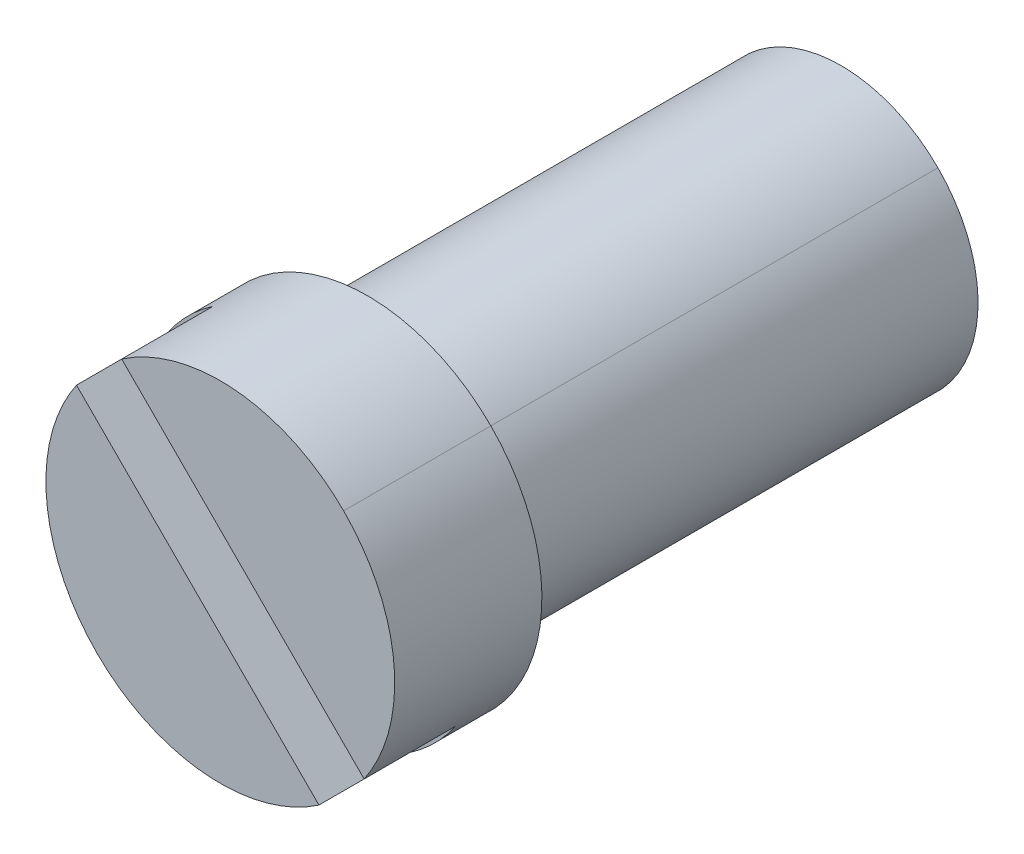
ISO-10303-21;
HEADER;
FILE_DESCRIPTION(('STEP AP214'),'2;1');
FILE_NAME('part.step','',(''),(''),'','','');
FILE_SCHEMA(('AUTOMOTIVE_DESIGN { 1 0 10303 214 1 1 1 1 }'));
ENDSEC;
DATA;
#1=APPLICATION_CONTEXT('core data for automotive mechanical design processes');
#2=APPLICATION_PROTOCOL_DEFINITION('international standard','automotive_design',2000,#1);
#3=PRODUCT_CONTEXT('',#1,'mechanical');
#4=PRODUCT('Part','Part','',(#3));
#5=PRODUCT_RELATED_PRODUCT_CATEGORY('part','',(#4));
#6=PRODUCT_DEFINITION_FORMATION('','',#4);
#7=PRODUCT_DEFINITION_CONTEXT('part definition',#1,'design');
#8=PRODUCT_DEFINITION('design','',#6,#7);
#9=PRODUCT_DEFINITION_SHAPE('','',#8);
#10=(LENGTH_UNIT() NAMED_UNIT(*) SI_UNIT(.MILLI.,.METRE.));
#11=(NAMED_UNIT(*) PLANE_ANGLE_UNIT() SI_UNIT($,.RADIAN.));
#12=(NAMED_UNIT(*) SI_UNIT($,.STERADIAN.) SOLID_ANGLE_UNIT());
#13=UNCERTAINTY_MEASURE_WITH_UNIT(LENGTH_MEASURE(1.E-05),#10,'distance_accuracy_value','');
#14=(GEOMETRIC_REPRESENTATION_CONTEXT(3) GLOBAL_UNCERTAINTY_ASSIGNED_CONTEXT((#13)) GLOBAL_UNIT_ASSIGNED_CONTEXT((#10,
#11,#12)) REPRESENTATION_CONTEXT('',''));
#15=CARTESIAN_POINT('',(0.,0.,0.));
#16=DIRECTION('',(0.,0.,1.));
#17=DIRECTION('',(1.,0.,0.));
#18=AXIS2_PLACEMENT_3D('',#15,#16,#17);
#19=CARTESIAN_POINT('',(17.780343805971,5.27034380597093,8.76943375672969));
#20=DIRECTION('',(0.,0.,1.));
#21=DIRECTION('',(0.707106781186547,0.707106781186548,0.));
#22=AXIS2_PLACEMENT_3D('',#19,#20,#21);
#23=CYLINDRICAL_SURFACE('',#22,1.5);
#24=DIRECTION('',(0.,0.,-1.));
#25=VECTOR('',#24,1.);
#26=CARTESIAN_POINT('',(18.8410039777508,6.33100397775075,8.76943375672969));
#27=LINE('',#26,#25);
#28=CARTESIAN_POINT('',(18.8410039777508,6.33100397775075,12.0176388374866));
#29=VERTEX_POINT('',#28);
#30=CARTESIAN_POINT('',(18.8410039777508,6.33100397775075,6.83));
#31=VERTEX_POINT('',#30);
#32=EDGE_CURVE('E28',#29,#31,#27,.T.);
#33=ORIENTED_EDGE('',*,*,#32,.F.);
#34=CARTESIAN_POINT('',(17.780343805971,5.27034380597093,12.0176388374866));
#35=DIRECTION('',(0.,0.,-1.));
#36=DIRECTION('',(0.707106781186547,0.707106781186548,0.));
#37=AXIS2_PLACEMENT_3D('',#34,#35,#36);
#38=CIRCLE('',#37,1.5);
#39=CARTESIAN_POINT('',(16.7196836341912,4.20968363419111,12.0176388374866));
#40=VERTEX_POINT('',#39);
#41=EDGE_CURVE('E153',#29,#40,#38,.T.);
#42=ORIENTED_EDGE('',*,*,#41,.T.);
#43=DIRECTION('',(0.,0.,-1.));
#44=VECTOR('',#43,1.);
#45=CARTESIAN_POINT('',(16.7196836341912,4.20968363419111,8.76943375672969));
#46=LINE('',#45,#44);
#47=CARTESIAN_POINT('',(16.7196836341912,4.20968363419111,6.83));
#48=VERTEX_POINT('',#47);
#49=EDGE_CURVE('E118',#40,#48,#46,.T.);
#50=ORIENTED_EDGE('',*,*,#49,.T.);
#51=CARTESIAN_POINT('',(17.780343805971,5.27034380597093,6.83));
#52=DIRECTION('',(0.,0.,-1.));
#53=DIRECTION('',(0.707106781186547,0.707106781186548,0.));
#54=AXIS2_PLACEMENT_3D('',#51,#52,#53);
#55=CIRCLE('',#54,1.5);
#56=EDGE_CURVE('E119',#31,#48,#55,.T.);
#57=ORIENTED_EDGE('',*,*,#56,.F.);
#58=EDGE_LOOP('',(#33,#42,#50,#57));
#59=FACE_BOUND('',#58,.T.);
#60=ADVANCED_FACE('F17',(#59),#23,.T.);
#61=CARTESIAN_POINT('',(17.780343805971,5.27034380597093,12.8238194187433));
#62=DIRECTION('',(0.,0.,-1.));
#63=DIRECTION('',(0.707106781186545,0.70710678118655,0.));
#64=AXIS2_PLACEMENT_3D('',#61,#62,#63);
#65=CYLINDRICAL_SURFACE('',#64,1.91034380597093);
#66=DIRECTION('',(0.,0.,1.));
#67=VECTOR('',#66,1.);
#68=CARTESIAN_POINT('',(16.4295267463712,3.91952674637119,12.8238194187433));
#69=LINE('',#68,#67);
#70=CARTESIAN_POINT('',(16.4295267463712,3.91952674637119,12.0176388374866));
#71=VERTEX_POINT('',#70);
#72=CARTESIAN_POINT('',(16.4295267463712,3.91952674637119,13.63));
#73=VERTEX_POINT('',#72);
#74=EDGE_CURVE('E152',#71,#73,#69,.T.);
#75=ORIENTED_EDGE('',*,*,#74,.T.);
#76=CARTESIAN_POINT('',(17.780343805971,5.27034380597093,13.63));
#77=DIRECTION('',(0.,0.,1.));
#78=DIRECTION('',(0.707106781186545,0.70710678118655,0.));
#79=AXIS2_PLACEMENT_3D('',#76,#77,#78);
#80=CIRCLE('',#79,1.91034380597093);
#81=CARTESIAN_POINT('',(16.2049043519045,6.35080851320685,13.63));
#82=VERTEX_POINT('',#81);
#83=EDGE_CURVE('E68',#82,#73,#80,.T.);
#84=ORIENTED_EDGE('',*,*,#83,.F.);
#85=DIRECTION('',(0.,0.,1.));
#86=VECTOR('',#85,1.);
#87=CARTESIAN_POINT('',(16.2049043519045,6.35080851320685,12.8238194187433));
#88=LINE('',#87,#86);
#89=CARTESIAN_POINT('',(16.2049043519045,6.35080851320685,12.63));
#90=VERTEX_POINT('',#89);
#91=EDGE_CURVE('E121',#90,#82,#88,.T.);
#92=ORIENTED_EDGE('',*,*,#91,.F.);
#93=CARTESIAN_POINT('',(17.780343805971,5.27034380597093,12.63));
#94=DIRECTION('',(0.,0.,1.));
#95=DIRECTION('',(0.707106781186545,0.70710678118655,0.));
#96=AXIS2_PLACEMENT_3D('',#93,#94,#95);
#97=CIRCLE('',#96,1.91034380597093);
#98=CARTESIAN_POINT('',(16.6998790987351,6.84578326003743,12.63));
#99=VERTEX_POINT('',#98);
#100=EDGE_CURVE('E21',#99,#90,#97,.T.);
#101=ORIENTED_EDGE('',*,*,#100,.F.);
#102=DIRECTION('',(0.,0.,1.));
#103=VECTOR('',#102,1.);
#104=CARTESIAN_POINT('',(16.6998790987351,6.84578326003743,12.8238194187433));
#105=LINE('',#104,#103);
#106=CARTESIAN_POINT('',(16.6998790987351,6.84578326003743,13.63));
#107=VERTEX_POINT('',#106);
#108=EDGE_CURVE('E173',#99,#107,#105,.T.);
#109=ORIENTED_EDGE('',*,*,#108,.T.);
#110=CARTESIAN_POINT('',(17.780343805971,5.27034380597093,13.63));
#111=DIRECTION('',(0.,0.,1.));
#112=DIRECTION('',(0.707106781186545,0.70710678118655,0.));
#113=AXIS2_PLACEMENT_3D('',#110,#111,#112);
#114=CIRCLE('',#113,1.91034380597093);
#115=CARTESIAN_POINT('',(19.1311608655707,6.62116086557068,13.63));
#116=VERTEX_POINT('',#115);
#117=EDGE_CURVE('E11',#116,#107,#114,.T.);
#118=ORIENTED_EDGE('',*,*,#117,.F.);
#119=DIRECTION('',(0.,0.,1.));
#120=VECTOR('',#119,1.);
#121=CARTESIAN_POINT('',(19.1311608655707,6.62116086557068,12.8238194187433));
#122=LINE('',#121,#120);
#123=CARTESIAN_POINT('',(19.1311608655707,6.62116086557068,12.0176388374866));
#124=VERTEX_POINT('',#123);
#125=EDGE_CURVE('E148',#124,#116,#122,.T.);
#126=ORIENTED_EDGE('',*,*,#125,.F.);
#127=CARTESIAN_POINT('',(17.780343805971,5.27034380597093,12.0176388374866));
#128=DIRECTION('',(0.,0.,-1.));
#129=DIRECTION('',(0.70710678118655,-0.707106781186545,0.));
#130=AXIS2_PLACEMENT_3D('',#127,#128,#129);
#131=CIRCLE('',#130,1.91034380597093);
#132=EDGE_CURVE('E165',#71,#124,#131,.T.);
#133=ORIENTED_EDGE('',*,*,#132,.F.);
#134=EDGE_LOOP('',(#75,#84,#92,#101,#109,#118,#126,#133));
#135=FACE_BOUND('',#134,.T.);
#136=ADVANCED_FACE('F122',(#135),#65,.T.);
#137=CARTESIAN_POINT('',(18.8822202938885,4.16846731805341,13.63));
#138=DIRECTION('',(0.,0.,-1.));
#139=DIRECTION('',(0.,-1.,0.));
#140=AXIS2_PLACEMENT_3D('',#137,#138,#139);
#141=PLANE('',#140);
#142=DIRECTION('',(-0.707106781186548,0.707106781186547,0.));
#143=VECTOR('',#142,1.);
#144=CARTESIAN_POINT('',(18.0278311793863,5.51783117938623,13.63));
#145=LINE('',#144,#143);
#146=CARTESIAN_POINT('',(19.3557832600374,4.1898790987351,13.63));
#147=VERTEX_POINT('',#146);
#148=EDGE_CURVE('E140',#147,#107,#145,.T.);
#149=ORIENTED_EDGE('',*,*,#148,.F.);
#150=CARTESIAN_POINT('',(17.780343805971,5.27034380597093,13.63));
#151=DIRECTION('',(0.,0.,1.));
#152=DIRECTION('',(0.707106781186545,0.70710678118655,0.));
#153=AXIS2_PLACEMENT_3D('',#150,#151,#152);
#154=CIRCLE('',#153,1.91034380597093);
#155=EDGE_CURVE('E170',#147,#116,#154,.T.);
#156=ORIENTED_EDGE('',*,*,#155,.T.);
#157=ORIENTED_EDGE('',*,*,#117,.T.);
#158=EDGE_LOOP('',(#149,#156,#157));
#159=FACE_BOUND('',#158,.T.);
#160=ADVANCED_FACE('F187',(#159),#141,.F.);
#161=CARTESIAN_POINT('',(17.780343805971,5.27034380597093,8.76943375672969));
#162=DIRECTION('',(0.,0.,1.));
#163=DIRECTION('',(0.707106781186547,0.707106781186548,0.));
#164=AXIS2_PLACEMENT_3D('',#161,#162,#163);
#165=CYLINDRICAL_SURFACE('',#164,1.5);
#166=CARTESIAN_POINT('',(17.780343805971,5.27034380597093,6.83));
#167=DIRECTION('',(0.,0.,-1.));
#168=DIRECTION('',(0.707106781186547,0.707106781186548,0.));
#169=AXIS2_PLACEMENT_3D('',#166,#167,#168);
#170=CIRCLE('',#169,1.5);
#171=EDGE_CURVE('E162',#48,#31,#170,.T.);
#172=ORIENTED_EDGE('',*,*,#171,.F.);
#173=ORIENTED_EDGE('',*,*,#49,.F.);
#174=CARTESIAN_POINT('',(17.780343805971,5.27034380597093,12.0176388374866));
#175=DIRECTION('',(0.,0.,-1.));
#176=DIRECTION('',(0.707106781186547,0.707106781186548,0.));
#177=AXIS2_PLACEMENT_3D('',#174,#175,#176);
#178=CIRCLE('',#177,1.5);
#179=EDGE_CURVE('E157',#40,#29,#178,.T.);
#180=ORIENTED_EDGE('',*,*,#179,.T.);
#181=ORIENTED_EDGE('',*,*,#32,.T.);
#182=EDGE_LOOP('',(#172,#173,#180,#181));
#183=FACE_BOUND('',#182,.T.);
#184=ADVANCED_FACE('F234',(#183),#165,.T.);
#185=CARTESIAN_POINT('',(16.4156260212247,7.13003633754783,12.63));
#186=DIRECTION('',(0.,0.,-1.));
#187=DIRECTION('',(0.,-1.,0.));
#188=AXIS2_PLACEMENT_3D('',#185,#186,#187);
#189=PLANE('',#188);
#190=DIRECTION('',(-0.707106781186548,0.707106781186547,0.));
#191=VECTOR('',#190,1.);
#192=CARTESIAN_POINT('',(18.0278311793863,5.51783117938623,12.63));
#193=LINE('',#192,#191);
#194=CARTESIAN_POINT('',(19.3557832600374,4.1898790987351,12.63));
#195=VERTEX_POINT('',#194);
#196=EDGE_CURVE('E115',#195,#99,#193,.T.);
#197=ORIENTED_EDGE('',*,*,#196,.T.);
#198=ORIENTED_EDGE('',*,*,#100,.T.);
#199=DIRECTION('',(0.707106781186548,-0.707106781186547,0.));
#200=VECTOR('',#199,1.);
#201=CARTESIAN_POINT('',(17.5328564325557,5.02285643255565,12.63));
#202=LINE('',#201,#200);
#203=CARTESIAN_POINT('',(18.8608085132068,3.69490435190452,12.63));
#204=VERTEX_POINT('',#203);
#205=EDGE_CURVE('E113',#90,#204,#202,.T.);
#206=ORIENTED_EDGE('',*,*,#205,.T.);
#207=CARTESIAN_POINT('',(17.780343805971,5.27034380597093,12.63));
#208=DIRECTION('',(0.,0.,1.));
#209=DIRECTION('',(0.707106781186545,0.70710678118655,0.));
#210=AXIS2_PLACEMENT_3D('',#207,#208,#209);
#211=CIRCLE('',#210,1.91034380597093);
#212=EDGE_CURVE('E101',#204,#195,#211,.T.);
#213=ORIENTED_EDGE('',*,*,#212,.T.);
#214=EDGE_LOOP('',(#197,#198,#206,#213));
#215=FACE_BOUND('',#214,.T.);
#216=ADVANCED_FACE('F111',(#215),#189,.F.);
#217=CARTESIAN_POINT('',(17.3825962415535,4.8725962415535,6.83));
#218=DIRECTION('',(0.,0.,1.));
#219=DIRECTION('',(0.,-1.,0.));
#220=AXIS2_PLACEMENT_3D('',#217,#218,#219);
#221=PLANE('',#220);
#222=ORIENTED_EDGE('',*,*,#171,.T.);
#223=ORIENTED_EDGE('',*,*,#56,.T.);
#224=EDGE_LOOP('',(#222,#223));
#225=FACE_BOUND('',#224,.T.);
#226=ADVANCED_FACE('F210',(#225),#221,.F.);
#227=CARTESIAN_POINT('',(18.8822202938885,4.16846731805341,13.63));
#228=DIRECTION('',(0.,0.,-1.));
#229=DIRECTION('',(0.,-1.,0.));
#230=AXIS2_PLACEMENT_3D('',#227,#228,#229);
#231=PLANE('',#230);
#232=CARTESIAN_POINT('',(17.780343805971,5.27034380597093,13.63));
#233=DIRECTION('',(0.,0.,1.));
#234=DIRECTION('',(0.707106781186545,0.70710678118655,0.));
#235=AXIS2_PLACEMENT_3D('',#232,#233,#234);
#236=CIRCLE('',#235,1.91034380597093);
#237=CARTESIAN_POINT('',(18.8608085132068,3.69490435190452,13.63));
#238=VERTEX_POINT('',#237);
#239=EDGE_CURVE('E149',#73,#238,#236,.T.);
#240=ORIENTED_EDGE('',*,*,#239,.T.);
#241=DIRECTION('',(0.707106781186548,-0.707106781186547,0.));
#242=VECTOR('',#241,1.);
#243=CARTESIAN_POINT('',(17.5328564325557,5.02285643255565,13.63));
#244=LINE('',#243,#242);
#245=EDGE_CURVE('E126',#82,#238,#244,.T.);
#246=ORIENTED_EDGE('',*,*,#245,.F.);
#247=ORIENTED_EDGE('',*,*,#83,.T.);
#248=EDGE_LOOP('',(#240,#246,#247));
#249=FACE_BOUND('',#248,.T.);
#250=ADVANCED_FACE('F208',(#249),#231,.F.);
#251=CARTESIAN_POINT('',(18.9455851493971,4.10510246254486,12.0176388374866));
#252=DIRECTION('',(0.,0.,1.));
#253=DIRECTION('',(0.,-1.,0.));
#254=AXIS2_PLACEMENT_3D('',#251,#252,#253);
#255=PLANE('',#254);
#256=ORIENTED_EDGE('',*,*,#179,.F.);
#257=ORIENTED_EDGE('',*,*,#41,.F.);
#258=EDGE_LOOP('',(#256,#257));
#259=FACE_BOUND('',#258,.T.);
#260=CARTESIAN_POINT('',(17.780343805971,5.27034380597093,12.0176388374866));
#261=DIRECTION('',(0.,0.,-1.));
#262=DIRECTION('',(0.70710678118655,-0.707106781186545,0.));
#263=AXIS2_PLACEMENT_3D('',#260,#261,#262);
#264=CIRCLE('',#263,1.91034380597093);
#265=EDGE_CURVE('E144',#124,#71,#264,.T.);
#266=ORIENTED_EDGE('',*,*,#265,.T.);
#267=ORIENTED_EDGE('',*,*,#132,.T.);
#268=EDGE_LOOP('',(#266,#267));
#269=FACE_BOUND('',#268,.T.);
#270=ADVANCED_FACE('F19',(#259,#269),#255,.F.);
#271=CARTESIAN_POINT('',(17.780343805971,5.27034380597093,12.8238194187433));
#272=DIRECTION('',(0.,0.,-1.));
#273=DIRECTION('',(0.707106781186545,0.70710678118655,0.));
#274=AXIS2_PLACEMENT_3D('',#271,#272,#273);
#275=CYLINDRICAL_SURFACE('',#274,1.91034380597093);
#276=ORIENTED_EDGE('',*,*,#265,.F.);
#277=ORIENTED_EDGE('',*,*,#125,.T.);
#278=ORIENTED_EDGE('',*,*,#155,.F.);
#279=DIRECTION('',(0.,0.,1.));
#280=VECTOR('',#279,1.);
#281=CARTESIAN_POINT('',(19.3557832600374,4.1898790987351,12.8238194187433));
#282=LINE('',#281,#280);
#283=EDGE_CURVE('E130',#195,#147,#282,.T.);
#284=ORIENTED_EDGE('',*,*,#283,.F.);
#285=ORIENTED_EDGE('',*,*,#212,.F.);
#286=DIRECTION('',(0.,0.,1.));
#287=VECTOR('',#286,1.);
#288=CARTESIAN_POINT('',(18.8608085132068,3.69490435190452,12.8238194187433));
#289=LINE('',#288,#287);
#290=EDGE_CURVE('E128',#204,#238,#289,.T.);
#291=ORIENTED_EDGE('',*,*,#290,.T.);
#292=ORIENTED_EDGE('',*,*,#239,.F.);
#293=ORIENTED_EDGE('',*,*,#74,.F.);
#294=EDGE_LOOP('',(#276,#277,#278,#284,#285,#291,#292,#293));
#295=FACE_BOUND('',#294,.T.);
#296=ADVANCED_FACE('F206',(#295),#275,.T.);
#297=CARTESIAN_POINT('',(15.9206512743941,6.63506159071725,12.63));
#298=DIRECTION('',(-0.707106781186547,-0.707106781186548,0.));
#299=DIRECTION('',(-0.707106781186548,0.707106781186547,0.));
#300=AXIS2_PLACEMENT_3D('',#297,#298,#299);
#301=PLANE('',#300);
#302=ORIENTED_EDGE('',*,*,#205,.F.);
#303=ORIENTED_EDGE('',*,*,#91,.T.);
#304=ORIENTED_EDGE('',*,*,#245,.T.);
#305=ORIENTED_EDGE('',*,*,#290,.F.);
#306=EDGE_LOOP('',(#302,#303,#304,#305));
#307=FACE_BOUND('',#306,.T.);
#308=ADVANCED_FACE('F127',(#307),#301,.F.);
#309=CARTESIAN_POINT('',(16.4156260212247,7.13003633754783,14.515608753973));
#310=DIRECTION('',(0.707106781186547,0.707106781186548,0.));
#311=DIRECTION('',(0.,0.,-1.));
#312=AXIS2_PLACEMENT_3D('',#309,#310,#311);
#313=PLANE('',#312);
#314=ORIENTED_EDGE('',*,*,#148,.T.);
#315=ORIENTED_EDGE('',*,*,#108,.F.);
#316=ORIENTED_EDGE('',*,*,#196,.F.);
#317=ORIENTED_EDGE('',*,*,#283,.T.);
#318=EDGE_LOOP('',(#314,#315,#316,#317));
#319=FACE_BOUND('',#318,.T.);
#320=ADVANCED_FACE('F185',(#319),#313,.F.);
#321=CLOSED_SHELL('',(#60,#136,#160,#184,#216,#226,#250,#270,#296,#308,#320));
#322=MANIFOLD_SOLID_BREP('B1',#321);
#323=ADVANCED_BREP_SHAPE_REPRESENTATION('',(#18,#322),#14);
#324=SHAPE_DEFINITION_REPRESENTATION(#9,#323);
ENDSEC;
END-ISO-10303-21;
